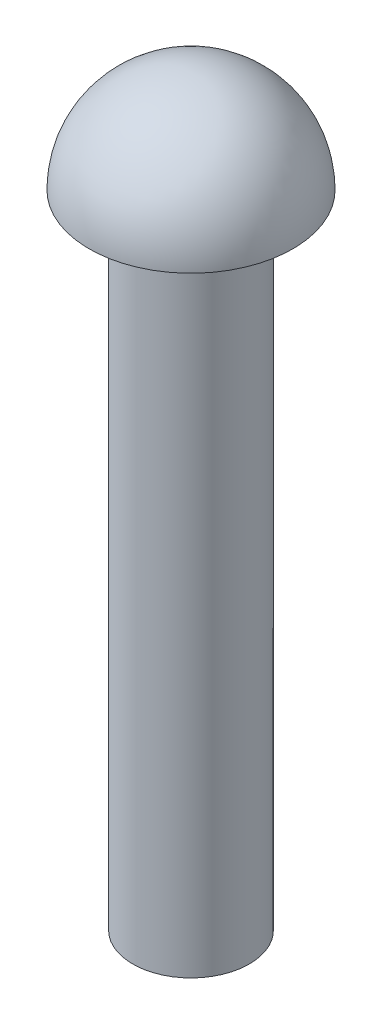
ISO-10303-21;
HEADER;
FILE_DESCRIPTION(('STEP AP214'),'2;1');
FILE_NAME('part.step','',(''),(''),'','','');
FILE_SCHEMA(('AUTOMOTIVE_DESIGN { 1 0 10303 214 1 1 1 1 }'));
ENDSEC;
DATA;
#1=APPLICATION_CONTEXT('core data for automotive mechanical design processes');
#2=APPLICATION_PROTOCOL_DEFINITION('international standard','automotive_design',2000,#1);
#3=PRODUCT_CONTEXT('',#1,'mechanical');
#4=PRODUCT('Part','Part','',(#3));
#5=PRODUCT_RELATED_PRODUCT_CATEGORY('part','',(#4));
#6=PRODUCT_DEFINITION_FORMATION('','',#4);
#7=PRODUCT_DEFINITION_CONTEXT('part definition',#1,'design');
#8=PRODUCT_DEFINITION('design','',#6,#7);
#9=PRODUCT_DEFINITION_SHAPE('','',#8);
#10=(LENGTH_UNIT() NAMED_UNIT(*) SI_UNIT(.MILLI.,.METRE.));
#11=(NAMED_UNIT(*) PLANE_ANGLE_UNIT() SI_UNIT($,.RADIAN.));
#12=(NAMED_UNIT(*) SI_UNIT($,.STERADIAN.) SOLID_ANGLE_UNIT());
#13=UNCERTAINTY_MEASURE_WITH_UNIT(LENGTH_MEASURE(1.E-05),#10,'distance_accuracy_value','');
#14=(GEOMETRIC_REPRESENTATION_CONTEXT(3) GLOBAL_UNCERTAINTY_ASSIGNED_CONTEXT((#13)) GLOBAL_UNIT_ASSIGNED_CONTEXT((#10,
#11,#12)) REPRESENTATION_CONTEXT('',''));
#15=CARTESIAN_POINT('',(0.,0.,0.));
#16=DIRECTION('',(0.,0.,1.));
#17=DIRECTION('',(1.,0.,0.));
#18=AXIS2_PLACEMENT_3D('',#15,#16,#17);
#19=CARTESIAN_POINT('',(0.,34.925,0.));
#20=DIRECTION('',(0.,-1.,0.));
#21=DIRECTION('',(-1.,0.,0.));
#22=AXIS2_PLACEMENT_3D('',#19,#20,#21);
#23=SPHERICAL_SURFACE('',#22,5.5499);
#24=CARTESIAN_POINT('',(0.,34.925,0.));
#25=DIRECTION('',(0.,-1.,0.));
#26=DIRECTION('',(0.,0.,-1.));
#27=AXIS2_PLACEMENT_3D('',#24,#25,#26);
#28=CIRCLE('',#27,5.5499);
#29=CARTESIAN_POINT('',(0.,34.925,-5.5499));
#30=VERTEX_POINT('',#29);
#31=EDGE_CURVE('E48',#30,#30,#28,.T.);
#32=ORIENTED_EDGE('',*,*,#31,.F.);
#33=EDGE_LOOP('',(#32));
#34=FACE_BOUND('',#33,.T.);
#35=ADVANCED_FACE('F32',(#34),#23,.T.);
#36=CARTESIAN_POINT('',(3.175,34.925,0.));
#37=DIRECTION('',(0.,1.,0.));
#38=DIRECTION('',(0.,0.,1.));
#39=AXIS2_PLACEMENT_3D('',#36,#37,#38);
#40=PLANE('',#39);
#41=CARTESIAN_POINT('',(0.,34.925,0.));
#42=DIRECTION('',(0.,-1.,0.));
#43=DIRECTION('',(0.,0.,-1.));
#44=AXIS2_PLACEMENT_3D('',#41,#42,#43);
#45=CIRCLE('',#44,3.175);
#46=CARTESIAN_POINT('',(0.,34.925,-3.175));
#47=VERTEX_POINT('',#46);
#48=EDGE_CURVE('E53',#47,#47,#45,.T.);
#49=ORIENTED_EDGE('',*,*,#48,.F.);
#50=EDGE_LOOP('',(#49));
#51=FACE_BOUND('',#50,.T.);
#52=ORIENTED_EDGE('',*,*,#31,.T.);
#53=EDGE_LOOP('',(#52));
#54=FACE_BOUND('',#53,.T.);
#55=ADVANCED_FACE('F65',(#51,#54),#40,.F.);
#56=CARTESIAN_POINT('',(0.,0.,0.));
#57=DIRECTION('',(0.,-1.,0.));
#58=DIRECTION('',(0.,0.,-1.));
#59=AXIS2_PLACEMENT_3D('',#56,#57,#58);
#60=CYLINDRICAL_SURFACE('',#59,3.175);
#61=CARTESIAN_POINT('',(0.,0.,0.));
#62=DIRECTION('',(0.,-1.,0.));
#63=DIRECTION('',(0.,0.,-1.));
#64=AXIS2_PLACEMENT_3D('',#61,#62,#63);
#65=CIRCLE('',#64,3.175);
#66=CARTESIAN_POINT('',(0.,0.,-3.175));
#67=VERTEX_POINT('',#66);
#68=EDGE_CURVE('E56',#67,#67,#65,.T.);
#69=ORIENTED_EDGE('',*,*,#68,.F.);
#70=EDGE_LOOP('',(#69));
#71=FACE_BOUND('',#70,.T.);
#72=ORIENTED_EDGE('',*,*,#48,.T.);
#73=EDGE_LOOP('',(#72));
#74=FACE_BOUND('',#73,.T.);
#75=ADVANCED_FACE('F62',(#71,#74),#60,.T.);
#76=CARTESIAN_POINT('',(0.,0.,0.));
#77=DIRECTION('',(0.,1.,0.));
#78=DIRECTION('',(0.,0.,1.));
#79=AXIS2_PLACEMENT_3D('',#76,#77,#78);
#80=PLANE('',#79);
#81=ORIENTED_EDGE('',*,*,#68,.T.);
#82=EDGE_LOOP('',(#81));
#83=FACE_BOUND('',#82,.T.);
#84=ADVANCED_FACE('F60',(#83),#80,.F.);
#85=CLOSED_SHELL('',(#35,#55,#75,#84));
#86=CARTESIAN_POINT('',(0.,2.54,0.));
#87=DIRECTION('',(0.,1.,0.));
#88=DIRECTION('',(0.,0.,1.));
#89=AXIS2_PLACEMENT_3D('',#86,#87,#88);
#90=PLANE('',#89);
#91=CARTESIAN_POINT('',(0.,2.54,0.));
#92=DIRECTION('',(0.,-1.,0.));
#93=DIRECTION('',(0.,0.,-1.));
#94=AXIS2_PLACEMENT_3D('',#91,#92,#93);
#95=CIRCLE('',#94,0.635);
#96=CARTESIAN_POINT('',(0.,2.54,-0.635));
#97=VERTEX_POINT('',#96);
#98=EDGE_CURVE('E10',#97,#97,#95,.T.);
#99=ORIENTED_EDGE('',*,*,#98,.F.);
#100=EDGE_LOOP('',(#99));
#101=FACE_BOUND('',#100,.T.);
#102=ADVANCED_FACE('F34',(#101),#90,.T.);
#103=CARTESIAN_POINT('',(0.,0.,0.));
#104=DIRECTION('',(0.,-1.,0.));
#105=DIRECTION('',(0.,0.,-1.));
#106=AXIS2_PLACEMENT_3D('',#103,#104,#105);
#107=CYLINDRICAL_SURFACE('',#106,0.635);
#108=ORIENTED_EDGE('',*,*,#98,.T.);
#109=EDGE_LOOP('',(#108));
#110=FACE_BOUND('',#109,.T.);
#111=CARTESIAN_POINT('',(0.,37.465,0.));
#112=DIRECTION('',(0.,-1.,0.));
#113=DIRECTION('',(0.,0.,-1.));
#114=AXIS2_PLACEMENT_3D('',#111,#112,#113);
#115=CIRCLE('',#114,0.635);
#116=CARTESIAN_POINT('',(0.,37.465,-0.635));
#117=VERTEX_POINT('',#116);
#118=EDGE_CURVE('E40',#117,#117,#115,.T.);
#119=ORIENTED_EDGE('',*,*,#118,.F.);
#120=EDGE_LOOP('',(#119));
#121=FACE_BOUND('',#120,.T.);
#122=ADVANCED_FACE('F86',(#110,#121),#107,.F.);
#123=CARTESIAN_POINT('',(3.175,37.465,0.));
#124=DIRECTION('',(0.,1.,0.));
#125=DIRECTION('',(0.,0.,1.));
#126=AXIS2_PLACEMENT_3D('',#123,#124,#125);
#127=PLANE('',#126);
#128=ORIENTED_EDGE('',*,*,#118,.T.);
#129=EDGE_LOOP('',(#128));
#130=FACE_BOUND('',#129,.T.);
#131=CARTESIAN_POINT('',(0.,37.465,0.));
#132=DIRECTION('',(0.,-1.,0.));
#133=DIRECTION('',(0.,0.,-1.));
#134=AXIS2_PLACEMENT_3D('',#131,#132,#133);
#135=CIRCLE('',#134,1.61489876153274);
#136=CARTESIAN_POINT('',(0.,37.465,-1.61489876153274));
#137=VERTEX_POINT('',#136);
#138=EDGE_CURVE('E44',#137,#137,#135,.T.);
#139=ORIENTED_EDGE('',*,*,#138,.F.);
#140=EDGE_LOOP('',(#139));
#141=FACE_BOUND('',#140,.T.);
#142=ADVANCED_FACE('F82',(#130,#141),#127,.T.);
#143=CARTESIAN_POINT('',(0.,34.925,0.));
#144=DIRECTION('',(0.,-1.,0.));
#145=DIRECTION('',(-1.,0.,0.));
#146=AXIS2_PLACEMENT_3D('',#143,#144,#145);
#147=SPHERICAL_SURFACE('',#146,3.0099);
#148=ORIENTED_EDGE('',*,*,#138,.T.);
#149=EDGE_LOOP('',(#148));
#150=FACE_BOUND('',#149,.T.);
#151=ADVANCED_FACE('F79',(#150),#147,.F.);
#152=CLOSED_SHELL('',(#102,#122,#142,#151));
#153=ORIENTED_CLOSED_SHELL('',*,#152,.T.);
#154=BREP_WITH_VOIDS('B2',#85,(#153));
#155=ADVANCED_BREP_SHAPE_REPRESENTATION('',(#18,#154),#14);
#156=SHAPE_DEFINITION_REPRESENTATION(#9,#155);
ENDSEC;
END-ISO-10303-21;
